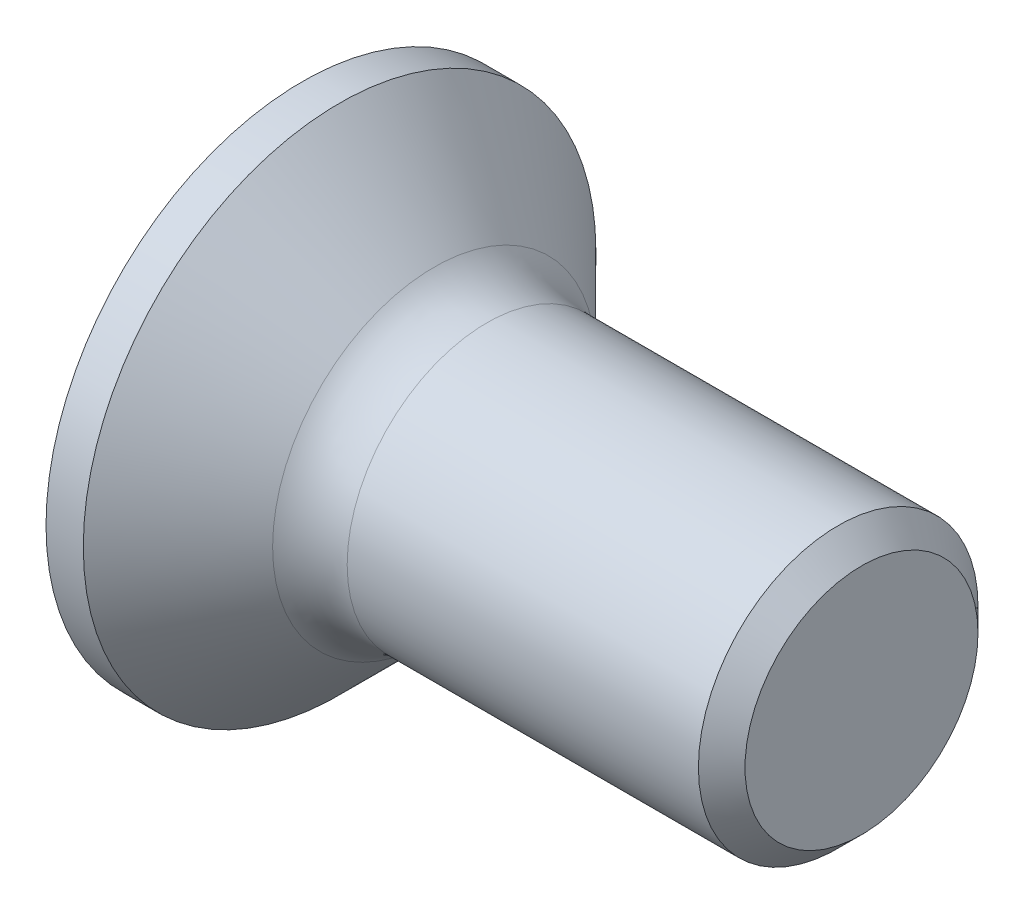
ISO-10303-21;
HEADER;
FILE_DESCRIPTION(('STEP AP214'),'2;1');
FILE_NAME('part.step','',(''),(''),'','','');
FILE_SCHEMA(('AUTOMOTIVE_DESIGN { 1 0 10303 214 1 1 1 1 }'));
ENDSEC;
DATA;
#1=APPLICATION_CONTEXT('core data for automotive mechanical design processes');
#2=APPLICATION_PROTOCOL_DEFINITION('international standard','automotive_design',2000,#1);
#3=PRODUCT_CONTEXT('',#1,'mechanical');
#4=PRODUCT('Part','Part','',(#3));
#5=PRODUCT_RELATED_PRODUCT_CATEGORY('part','',(#4));
#6=PRODUCT_DEFINITION_FORMATION('','',#4);
#7=PRODUCT_DEFINITION_CONTEXT('part definition',#1,'design');
#8=PRODUCT_DEFINITION('design','',#6,#7);
#9=PRODUCT_DEFINITION_SHAPE('','',#8);
#10=(LENGTH_UNIT() NAMED_UNIT(*) SI_UNIT(.MILLI.,.METRE.));
#11=(NAMED_UNIT(*) PLANE_ANGLE_UNIT() SI_UNIT($,.RADIAN.));
#12=(NAMED_UNIT(*) SI_UNIT($,.STERADIAN.) SOLID_ANGLE_UNIT());
#13=UNCERTAINTY_MEASURE_WITH_UNIT(LENGTH_MEASURE(1.E-05),#10,'distance_accuracy_value','');
#14=(GEOMETRIC_REPRESENTATION_CONTEXT(3) GLOBAL_UNCERTAINTY_ASSIGNED_CONTEXT((#13)) GLOBAL_UNIT_ASSIGNED_CONTEXT((#10,
#11,#12)) REPRESENTATION_CONTEXT('',''));
#15=CARTESIAN_POINT('',(0.,0.,0.));
#16=DIRECTION('',(0.,0.,1.));
#17=DIRECTION('',(1.,0.,0.));
#18=AXIS2_PLACEMENT_3D('',#15,#16,#17);
#19=CARTESIAN_POINT('',(0.,0.,0.));
#20=DIRECTION('',(-1.,0.,0.));
#21=DIRECTION('',(0.,0.,1.));
#22=AXIS2_PLACEMENT_3D('',#19,#20,#21);
#23=PLANE('',#22);
#24=CARTESIAN_POINT('',(0.,0.,0.));
#25=DIRECTION('',(-1.,0.,0.));
#26=DIRECTION('',(0.,0.,1.));
#27=AXIS2_PLACEMENT_3D('',#24,#25,#26);
#28=CIRCLE('',#27,2.75);
#29=CARTESIAN_POINT('',(0.,0.,2.75));
#30=VERTEX_POINT('',#29);
#31=EDGE_CURVE('E241',#30,#30,#28,.T.);
#32=ORIENTED_EDGE('',*,*,#31,.T.);
#33=EDGE_LOOP('',(#32));
#34=FACE_BOUND('',#33,.T.);
#35=DIRECTION('',(0.,0.,-1.));
#36=VECTOR('',#35,1.);
#37=CARTESIAN_POINT('',(0.,-0.370000000000005,1.5));
#38=LINE('',#37,#36);
#39=CARTESIAN_POINT('',(0.,-0.370000000000005,1.5));
#40=VERTEX_POINT('',#39);
#41=CARTESIAN_POINT('',(0.,-0.370000000000002,0.590157547916261));
#42=VERTEX_POINT('',#41);
#43=EDGE_CURVE('E330',#40,#42,#38,.T.);
#44=ORIENTED_EDGE('',*,*,#43,.T.);
#45=CARTESIAN_POINT('',(0.,0.,0.));
#46=DIRECTION('',(-1.,0.,0.));
#47=DIRECTION('',(0.,0.,1.));
#48=AXIS2_PLACEMENT_3D('',#45,#46,#47);
#49=CIRCLE('',#48,0.69655289200644);
#50=CARTESIAN_POINT('',(0.,-0.590157547916262,0.37));
#51=VERTEX_POINT('',#50);
#52=EDGE_CURVE('E365',#51,#42,#49,.T.);
#53=ORIENTED_EDGE('',*,*,#52,.F.);
#54=DIRECTION('',(0.,-1.,0.));
#55=VECTOR('',#54,1.);
#56=CARTESIAN_POINT('',(0.,1.5,0.37));
#57=LINE('',#56,#55);
#58=CARTESIAN_POINT('',(0.,-1.5,0.37));
#59=VERTEX_POINT('',#58);
#60=EDGE_CURVE('E282',#51,#59,#57,.T.);
#61=ORIENTED_EDGE('',*,*,#60,.T.);
#62=DIRECTION('',(0.,0.,-1.));
#63=VECTOR('',#62,1.);
#64=CARTESIAN_POINT('',(0.,-1.5,0.37));
#65=LINE('',#64,#63);
#66=CARTESIAN_POINT('',(0.,-1.5,-0.37));
#67=VERTEX_POINT('',#66);
#68=EDGE_CURVE('E287',#59,#67,#65,.T.);
#69=ORIENTED_EDGE('',*,*,#68,.T.);
#70=DIRECTION('',(0.,1.,0.));
#71=VECTOR('',#70,1.);
#72=CARTESIAN_POINT('',(0.,-1.5,-0.37));
#73=LINE('',#72,#71);
#74=CARTESIAN_POINT('',(0.,-0.590157547916263,-0.37));
#75=VERTEX_POINT('',#74);
#76=EDGE_CURVE('E283',#67,#75,#73,.T.);
#77=ORIENTED_EDGE('',*,*,#76,.T.);
#78=CARTESIAN_POINT('',(0.,-0.369999999999998,-0.590157547916264));
#79=VERTEX_POINT('',#78);
#80=EDGE_CURVE('E369',#79,#75,#49,.T.);
#81=ORIENTED_EDGE('',*,*,#80,.F.);
#82=CARTESIAN_POINT('',(0.,-0.369999999999995,-1.5));
#83=VERTEX_POINT('',#82);
#84=EDGE_CURVE('E335',#79,#83,#38,.T.);
#85=ORIENTED_EDGE('',*,*,#84,.T.);
#86=DIRECTION('',(0.,1.,0.));
#87=VECTOR('',#86,1.);
#88=CARTESIAN_POINT('',(0.,-0.369999999999995,-1.5));
#89=LINE('',#88,#87);
#90=CARTESIAN_POINT('',(0.,0.370000000000005,-1.5));
#91=VERTEX_POINT('',#90);
#92=EDGE_CURVE('E323',#83,#91,#89,.T.);
#93=ORIENTED_EDGE('',*,*,#92,.T.);
#94=DIRECTION('',(0.,0.,1.));
#95=VECTOR('',#94,1.);
#96=CARTESIAN_POINT('',(0.,0.370000000000005,-1.5));
#97=LINE('',#96,#95);
#98=CARTESIAN_POINT('',(0.,0.370000000000002,-0.590157547916261));
#99=VERTEX_POINT('',#98);
#100=EDGE_CURVE('E339',#91,#99,#97,.T.);
#101=ORIENTED_EDGE('',*,*,#100,.T.);
#102=CARTESIAN_POINT('',(0.,0.590157547916263,-0.37));
#103=VERTEX_POINT('',#102);
#104=EDGE_CURVE('E555',#103,#99,#49,.T.);
#105=ORIENTED_EDGE('',*,*,#104,.F.);
#106=CARTESIAN_POINT('',(0.,1.5,-0.37));
#107=VERTEX_POINT('',#106);
#108=EDGE_CURVE('E292',#103,#107,#73,.T.);
#109=ORIENTED_EDGE('',*,*,#108,.T.);
#110=DIRECTION('',(0.,0.,1.));
#111=VECTOR('',#110,1.);
#112=CARTESIAN_POINT('',(0.,1.5,-0.37));
#113=LINE('',#112,#111);
#114=CARTESIAN_POINT('',(0.,1.5,0.37));
#115=VERTEX_POINT('',#114);
#116=EDGE_CURVE('E279',#107,#115,#113,.T.);
#117=ORIENTED_EDGE('',*,*,#116,.T.);
#118=CARTESIAN_POINT('',(0.,0.590157547916263,0.37));
#119=VERTEX_POINT('',#118);
#120=EDGE_CURVE('E284',#115,#119,#57,.T.);
#121=ORIENTED_EDGE('',*,*,#120,.T.);
#122=CARTESIAN_POINT('',(0.,0.369999999999998,0.590157547916264));
#123=VERTEX_POINT('',#122);
#124=EDGE_CURVE('E371',#123,#119,#49,.T.);
#125=ORIENTED_EDGE('',*,*,#124,.F.);
#126=CARTESIAN_POINT('',(0.,0.369999999999994,1.5));
#127=VERTEX_POINT('',#126);
#128=EDGE_CURVE('E342',#123,#127,#97,.T.);
#129=ORIENTED_EDGE('',*,*,#128,.T.);
#130=DIRECTION('',(0.,-1.,0.));
#131=VECTOR('',#130,1.);
#132=CARTESIAN_POINT('',(0.,0.369999999999994,1.5));
#133=LINE('',#132,#131);
#134=EDGE_CURVE('E341',#127,#40,#133,.T.);
#135=ORIENTED_EDGE('',*,*,#134,.T.);
#136=EDGE_LOOP('',(#44,#53,#61,#69,#77,#81,#85,#93,#101,#105,#109,#117,#121,#125,#129,#135));
#137=FACE_BOUND('',#136,.T.);
#138=ADVANCED_FACE('F34',(#34,#137),#23,.T.);
#139=CARTESIAN_POINT('',(2.01,-0.49785100239185,0.37));
#140=DIRECTION('',(0.,0.,-1.));
#141=DIRECTION('',(0.,1.,0.));
#142=AXIS2_PLACEMENT_3D('',#139,#140,#141);
#143=PLANE('',#142);
#144=ORIENTED_EDGE('',*,*,#60,.F.);
#145=CARTESIAN_POINT('',(-1.01053649699026,-0.672102030078458,0.37));
#146=CARTESIAN_POINT('',(-0.799706058781647,-0.65526709888962,0.37));
#147=CARTESIAN_POINT('',(-0.588886212565098,-0.638297110577309,0.37));
#148=CARTESIAN_POINT('',(-0.167272662573759,-0.603984130523452,0.37));
#149=CARTESIAN_POINT('',(0.0435210405937217,-0.586641131327184,0.37));
#150=CARTESIAN_POINT('',(0.465068838236452,-0.551479911668094,0.37));
#151=CARTESIAN_POINT('',(0.675822932725247,-0.533661691368078,0.37));
#152=CARTESIAN_POINT('',(1.09727362087867,-0.497387538868942,0.37));
#153=CARTESIAN_POINT('',(1.30797021528206,-0.478931615293404,0.37));
#154=CARTESIAN_POINT('',(1.67418894765493,-0.446067164114376,0.37));
#155=CARTESIAN_POINT('',(1.82972932594024,-0.431862501020785,0.37));
#156=CARTESIAN_POINT('',(2.14074770367772,-0.402797709732015,0.37));
#157=CARTESIAN_POINT('',(2.29622570364502,-0.38793758706717,0.37));
#158=CARTESIAN_POINT('',(2.60710169356699,-0.357305117929346,0.37));
#159=CARTESIAN_POINT('',(2.76249967848536,-0.341532719782115,0.37));
#160=CARTESIAN_POINT('',(2.99549070750468,-0.316847908272698,0.37));
#161=CARTESIAN_POINT('',(3.07313791127142,-0.308448465888148,0.37));
#162=CARTESIAN_POINT('',(3.22838341584044,-0.291202251038989,0.37));
#163=CARTESIAN_POINT('',(3.30598171607669,-0.282355473489553,0.37));
#164=CARTESIAN_POINT('',(3.38354828471668,-0.273232461280215,0.37));
#165=B_SPLINE_CURVE_WITH_KNOTS('',3,(#145,#146,#147,#148,#149,#150,#151,#152,#153,#154,#155,
#156,#157,#158,#159,#160,#161,#162,#163,#164),.UNSPECIFIED.,.F.,.F.,(4,2,2,2,2,2,2,2,2,4),(0.,
0.634504777580944,1.26902224771403,1.90353950046914,2.53804817608336,3.00661008454961,
3.47516804035678,3.94375256285268,4.17805198347564,4.41235406796206),.UNSPECIFIED.);
#166=CARTESIAN_POINT('',(2.01,-0.415013252800437,0.37));
#167=VERTEX_POINT('',#166);
#168=EDGE_CURVE('E361',#51,#167,#165,.T.);
#169=ORIENTED_EDGE('',*,*,#168,.T.);
#170=DIRECTION('',(0.,-1.,0.));
#171=VECTOR('',#170,1.);
#172=CARTESIAN_POINT('',(2.01,0.497851002391851,0.37));
#173=LINE('',#172,#171);
#174=CARTESIAN_POINT('',(2.01,-0.497851002391851,0.37));
#175=VERTEX_POINT('',#174);
#176=EDGE_CURVE('E307',#167,#175,#173,.T.);
#177=ORIENTED_EDGE('',*,*,#176,.T.);
#178=DIRECTION('',(0.89493436774996,0.446197800778958,0.));
#179=VECTOR('',#178,1.);
#180=CARTESIAN_POINT('',(0.,-1.5,0.37));
#181=LINE('',#180,#179);
#182=EDGE_CURVE('E293',#59,#175,#181,.T.);
#183=ORIENTED_EDGE('',*,*,#182,.F.);
#184=EDGE_LOOP('',(#144,#169,#177,#183));
#185=FACE_BOUND('',#184,.T.);
#186=ADVANCED_FACE('F190',(#185),#143,.T.);
#187=CARTESIAN_POINT('',(2.01,0.497851002391851,0.37));
#188=VERTEX_POINT('',#187);
#189=CARTESIAN_POINT('',(2.01,0.415013252800437,0.37));
#190=VERTEX_POINT('',#189);
#191=EDGE_CURVE('E309',#188,#190,#173,.T.);
#192=ORIENTED_EDGE('',*,*,#191,.T.);
#193=CARTESIAN_POINT('',(-1.01053649691082,0.672102030072117,0.37));
#194=CARTESIAN_POINT('',(-0.799706058711029,0.655267098883947,0.37));
#195=CARTESIAN_POINT('',(-0.588886212503304,0.638297110572311,0.37));
#196=CARTESIAN_POINT('',(-0.16727266252961,0.603984130519827,0.37));
#197=CARTESIAN_POINT('',(0.0435210406290472,0.586641131324258,0.37));
#198=CARTESIAN_POINT('',(0.465068838244709,0.551479911667385,0.37));
#199=CARTESIAN_POINT('',(0.67582293271526,0.533661691368909,0.37));
#200=CARTESIAN_POINT('',(1.09727362083221,0.497387538872971,0.37));
#201=CARTESIAN_POINT('',(1.30797021521736,0.478931615299089,0.37));
#202=CARTESIAN_POINT('',(1.67418894757201,0.446067164121905,0.37));
#203=CARTESIAN_POINT('',(1.82972932585734,0.431862501028414,0.37));
#204=CARTESIAN_POINT('',(2.14074770359484,0.40279770973988,0.37));
#205=CARTESIAN_POINT('',(2.29622570356215,0.38793758707517,0.37));
#206=CARTESIAN_POINT('',(2.60710169348415,0.357305117937676,0.37));
#207=CARTESIAN_POINT('',(2.76249967840253,0.34153271979064,0.37));
#208=CARTESIAN_POINT('',(2.99549070742189,0.316847908281594,0.37));
#209=CARTESIAN_POINT('',(3.07313791118864,0.308448465897182,0.37));
#210=CARTESIAN_POINT('',(3.22838341575769,0.291202251048339,0.37));
#211=CARTESIAN_POINT('',(3.30598171599396,0.282355473499082,0.37));
#212=CARTESIAN_POINT('',(3.38354828463398,0.273232461289951,0.37));
#213=B_SPLINE_CURVE_WITH_KNOTS('',3,(#193,#194,#195,#196,#197,#198,#199,#200,#201,#202,#203,
#204,#205,#206,#207,#208,#209,#210,#211,#212),.UNSPECIFIED.,.F.,.F.,(4,2,2,2,2,2,2,2,2,4),(0.,
0.634504777554396,1.26902224766093,1.90353950036111,2.53804817592041,3.00661008438666,
3.47516804019383,3.94375256268972,4.17805198331267,4.41235406779909),.UNSPECIFIED.);
#214=EDGE_CURVE('E418',#190,#119,#213,.F.);
#215=ORIENTED_EDGE('',*,*,#214,.T.);
#216=ORIENTED_EDGE('',*,*,#120,.F.);
#217=DIRECTION('',(0.89493436774996,-0.446197800778958,0.));
#218=VECTOR('',#217,1.);
#219=CARTESIAN_POINT('',(0.,1.5,0.37));
#220=LINE('',#219,#218);
#221=EDGE_CURVE('E57',#115,#188,#220,.T.);
#222=ORIENTED_EDGE('',*,*,#221,.T.);
#223=EDGE_LOOP('',(#192,#215,#216,#222));
#224=FACE_BOUND('',#223,.T.);
#225=ADVANCED_FACE('F196',(#224),#143,.T.);
#226=CARTESIAN_POINT('',(2.01,0.497851002391851,-0.37));
#227=DIRECTION('',(0.,0.,1.));
#228=DIRECTION('',(1.,0.,0.));
#229=AXIS2_PLACEMENT_3D('',#226,#227,#228);
#230=PLANE('',#229);
#231=DIRECTION('',(0.,1.,0.));
#232=VECTOR('',#231,1.);
#233=CARTESIAN_POINT('',(2.01,-0.497851002391851,-0.37));
#234=LINE('',#233,#232);
#235=CARTESIAN_POINT('',(2.01,-0.497851002391851,-0.37));
#236=VERTEX_POINT('',#235);
#237=CARTESIAN_POINT('',(2.01,-0.415013252800437,-0.37));
#238=VERTEX_POINT('',#237);
#239=EDGE_CURVE('E315',#236,#238,#234,.T.);
#240=ORIENTED_EDGE('',*,*,#239,.T.);
#241=CARTESIAN_POINT('',(-1.01053649699026,-0.672102030078459,-0.369999999999999));
#242=CARTESIAN_POINT('',(-0.799706058781647,-0.65526709888962,-0.37));
#243=CARTESIAN_POINT('',(-0.588886212565098,-0.638297110577309,-0.37));
#244=CARTESIAN_POINT('',(-0.167272662573758,-0.603984130523452,-0.37));
#245=CARTESIAN_POINT('',(0.0435210405937223,-0.586641131327184,-0.37));
#246=CARTESIAN_POINT('',(0.465068838236453,-0.551479911668094,-0.37));
#247=CARTESIAN_POINT('',(0.675822932725248,-0.533661691368078,-0.37));
#248=CARTESIAN_POINT('',(1.09727362087867,-0.497387538868943,-0.37));
#249=CARTESIAN_POINT('',(1.30797021528206,-0.478931615293404,-0.37));
#250=CARTESIAN_POINT('',(1.67418894765493,-0.446067164114376,-0.37));
#251=CARTESIAN_POINT('',(1.82972932594025,-0.431862501020785,-0.37));
#252=CARTESIAN_POINT('',(2.14074770367772,-0.402797709732015,-0.37));
#253=CARTESIAN_POINT('',(2.29622570364503,-0.38793758706717,-0.37));
#254=CARTESIAN_POINT('',(2.60710169356699,-0.357305117929346,-0.37));
#255=CARTESIAN_POINT('',(2.76249967848536,-0.341532719782115,-0.37));
#256=CARTESIAN_POINT('',(2.99549070750468,-0.316847908272698,-0.37));
#257=CARTESIAN_POINT('',(3.07313791127142,-0.308448465888148,-0.37));
#258=CARTESIAN_POINT('',(3.22838341584044,-0.291202251038989,-0.37));
#259=CARTESIAN_POINT('',(3.30598171607669,-0.282355473489553,-0.37));
#260=CARTESIAN_POINT('',(3.38354828471668,-0.273232461280215,-0.37));
#261=B_SPLINE_CURVE_WITH_KNOTS('',3,(#241,#242,#243,#244,#245,#246,#247,#248,#249,#250,#251,
#252,#253,#254,#255,#256,#257,#258,#259,#260),.UNSPECIFIED.,.F.,.F.,(4,2,2,2,2,2,2,2,2,4),(0.,
0.634504777580944,1.26902224771403,1.90353950046914,2.53804817608336,3.00661008454961,
3.47516804035678,3.94375256285268,4.17805198347564,4.41235406796206),.UNSPECIFIED.);
#262=EDGE_CURVE('E425',#238,#75,#261,.F.);
#263=ORIENTED_EDGE('',*,*,#262,.T.);
#264=ORIENTED_EDGE('',*,*,#76,.F.);
#265=DIRECTION('',(0.89493436774996,0.446197800778958,0.));
#266=VECTOR('',#265,1.);
#267=CARTESIAN_POINT('',(0.,-1.5,-0.37));
#268=LINE('',#267,#266);
#269=EDGE_CURVE('E296',#67,#236,#268,.T.);
#270=ORIENTED_EDGE('',*,*,#269,.T.);
#271=EDGE_LOOP('',(#240,#263,#264,#270));
#272=FACE_BOUND('',#271,.T.);
#273=ADVANCED_FACE('F511',(#272),#230,.T.);
#274=ORIENTED_EDGE('',*,*,#108,.F.);
#275=CARTESIAN_POINT('',(-1.01053649699026,0.672102030078459,-0.369999999999999));
#276=CARTESIAN_POINT('',(-0.799706058781647,0.65526709888962,-0.37));
#277=CARTESIAN_POINT('',(-0.588886212565098,0.638297110577309,-0.37));
#278=CARTESIAN_POINT('',(-0.167272662573758,0.603984130523452,-0.37));
#279=CARTESIAN_POINT('',(0.0435210405937222,0.586641131327184,-0.37));
#280=CARTESIAN_POINT('',(0.465068838236453,0.551479911668094,-0.37));
#281=CARTESIAN_POINT('',(0.675822932725247,0.533661691368078,-0.37));
#282=CARTESIAN_POINT('',(1.09727362087867,0.497387538868943,-0.37));
#283=CARTESIAN_POINT('',(1.30797021528206,0.478931615293404,-0.37));
#284=CARTESIAN_POINT('',(1.67418894765493,0.446067164114376,-0.37));
#285=CARTESIAN_POINT('',(1.82972932594025,0.431862501020785,-0.37));
#286=CARTESIAN_POINT('',(2.14074770367772,0.402797709732015,-0.37));
#287=CARTESIAN_POINT('',(2.29622570364503,0.38793758706717,-0.37));
#288=CARTESIAN_POINT('',(2.60710169356699,0.357305117929346,-0.37));
#289=CARTESIAN_POINT('',(2.76249967848536,0.341532719782115,-0.37));
#290=CARTESIAN_POINT('',(2.99549070750468,0.316847908272698,-0.37));
#291=CARTESIAN_POINT('',(3.07313791127142,0.308448465888148,-0.37));
#292=CARTESIAN_POINT('',(3.22838341584044,0.291202251038989,-0.37));
#293=CARTESIAN_POINT('',(3.30598171607669,0.282355473489553,-0.37));
#294=CARTESIAN_POINT('',(3.38354828471668,0.273232461280215,-0.37));
#295=B_SPLINE_CURVE_WITH_KNOTS('',3,(#275,#276,#277,#278,#279,#280,#281,#282,#283,#284,#285,
#286,#287,#288,#289,#290,#291,#292,#293,#294),.UNSPECIFIED.,.F.,.F.,(4,2,2,2,2,2,2,2,2,4),(0.,
0.634504777580944,1.26902224771403,1.90353950046914,2.53804817608336,3.00661008454961,
3.47516804035678,3.94375256285268,4.17805198347564,4.41235406796206),.UNSPECIFIED.);
#296=CARTESIAN_POINT('',(2.01,0.415013252800437,-0.37));
#297=VERTEX_POINT('',#296);
#298=EDGE_CURVE('E423',#103,#297,#295,.T.);
#299=ORIENTED_EDGE('',*,*,#298,.T.);
#300=CARTESIAN_POINT('',(2.01,0.497851002391851,-0.37));
#301=VERTEX_POINT('',#300);
#302=EDGE_CURVE('E317',#297,#301,#234,.T.);
#303=ORIENTED_EDGE('',*,*,#302,.T.);
#304=DIRECTION('',(0.89493436774996,-0.446197800778958,0.));
#305=VECTOR('',#304,1.);
#306=CARTESIAN_POINT('',(0.,1.5,-0.37));
#307=LINE('',#306,#305);
#308=EDGE_CURVE('E300',#107,#301,#307,.T.);
#309=ORIENTED_EDGE('',*,*,#308,.F.);
#310=EDGE_LOOP('',(#274,#299,#303,#309));
#311=FACE_BOUND('',#310,.T.);
#312=ADVANCED_FACE('F422',(#311),#230,.T.);
#313=CARTESIAN_POINT('',(2.01,0.497851002391851,-0.37));
#314=DIRECTION('',(1.,0.,0.));
#315=DIRECTION('',(0.,0.,-1.));
#316=AXIS2_PLACEMENT_3D('',#313,#314,#315);
#317=PLANE('',#316);
#318=CARTESIAN_POINT('',(2.01,0.,0.));
#319=DIRECTION('',(-1.,0.,0.));
#320=DIRECTION('',(0.,0.,1.));
#321=AXIS2_PLACEMENT_3D('',#318,#319,#320);
#322=CIRCLE('',#321,0.555999999999999);
#323=CARTESIAN_POINT('',(2.01,-0.247548741498372,-0.497851002391851));
#324=VERTEX_POINT('',#323);
#325=CARTESIAN_POINT('',(2.01,-0.369999999999999,-0.415013252800438));
#326=VERTEX_POINT('',#325);
#327=EDGE_CURVE('E386',#324,#326,#322,.T.);
#328=ORIENTED_EDGE('',*,*,#327,.F.);
#329=DIRECTION('',(0.,1.,0.));
#330=VECTOR('',#329,1.);
#331=CARTESIAN_POINT('',(2.01,-0.369999999999998,-0.497851002391852));
#332=LINE('',#331,#330);
#333=CARTESIAN_POINT('',(2.01,-0.369999999999998,-0.497851002391852));
#334=VERTEX_POINT('',#333);
#335=EDGE_CURVE('E276',#334,#324,#332,.T.);
#336=ORIENTED_EDGE('',*,*,#335,.F.);
#337=DIRECTION('',(0.,0.,-1.));
#338=VECTOR('',#337,1.);
#339=CARTESIAN_POINT('',(2.01,-0.370000000000002,0.497851002391849));
#340=LINE('',#339,#338);
#341=EDGE_CURVE('E266',#326,#334,#340,.T.);
#342=ORIENTED_EDGE('',*,*,#341,.F.);
#343=EDGE_LOOP('',(#328,#336,#342));
#344=FACE_BOUND('',#343,.T.);
#345=ADVANCED_FACE('F203',(#344),#317,.F.);
#346=CARTESIAN_POINT('',(2.01,-0.497851002391851,-0.247548741498373));
#347=VERTEX_POINT('',#346);
#348=EDGE_CURVE('E380',#238,#347,#322,.T.);
#349=ORIENTED_EDGE('',*,*,#348,.F.);
#350=ORIENTED_EDGE('',*,*,#239,.F.);
#351=DIRECTION('',(0.,0.,-1.));
#352=VECTOR('',#351,1.);
#353=CARTESIAN_POINT('',(2.01,-0.497851002391851,0.37));
#354=LINE('',#353,#352);
#355=EDGE_CURVE('E312',#347,#236,#354,.T.);
#356=ORIENTED_EDGE('',*,*,#355,.F.);
#357=EDGE_LOOP('',(#349,#350,#356));
#358=FACE_BOUND('',#357,.T.);
#359=ADVANCED_FACE('F447',(#358),#317,.F.);
#360=CARTESIAN_POINT('',(2.01,-0.497851002391851,0.247548741498374));
#361=VERTEX_POINT('',#360);
#362=EDGE_CURVE('E374',#361,#167,#322,.T.);
#363=ORIENTED_EDGE('',*,*,#362,.F.);
#364=EDGE_CURVE('E303',#175,#361,#354,.T.);
#365=ORIENTED_EDGE('',*,*,#364,.F.);
#366=ORIENTED_EDGE('',*,*,#176,.F.);
#367=EDGE_LOOP('',(#363,#365,#366));
#368=FACE_BOUND('',#367,.T.);
#369=ADVANCED_FACE('F443',(#368),#317,.F.);
#370=CARTESIAN_POINT('',(2.01,-0.370000000000002,0.415013252800435));
#371=VERTEX_POINT('',#370);
#372=CARTESIAN_POINT('',(2.01,-0.247548741498376,0.49785100239185));
#373=VERTEX_POINT('',#372);
#374=EDGE_CURVE('E49',#371,#373,#322,.T.);
#375=ORIENTED_EDGE('',*,*,#374,.F.);
#376=CARTESIAN_POINT('',(2.01,-0.370000000000002,0.497851002391849));
#377=VERTEX_POINT('',#376);
#378=EDGE_CURVE('E263',#377,#371,#340,.T.);
#379=ORIENTED_EDGE('',*,*,#378,.F.);
#380=DIRECTION('',(0.,-1.,0.));
#381=VECTOR('',#380,1.);
#382=CARTESIAN_POINT('',(2.01,0.369999999999998,0.497851002391852));
#383=LINE('',#382,#381);
#384=EDGE_CURVE('E254',#373,#377,#383,.T.);
#385=ORIENTED_EDGE('',*,*,#384,.F.);
#386=EDGE_LOOP('',(#375,#379,#385));
#387=FACE_BOUND('',#386,.T.);
#388=ADVANCED_FACE('F261',(#387),#317,.F.);
#389=CARTESIAN_POINT('',(2.01,0.247548741498372,0.497851002391851));
#390=VERTEX_POINT('',#389);
#391=CARTESIAN_POINT('',(2.01,0.369999999999999,0.415013252800438));
#392=VERTEX_POINT('',#391);
#393=EDGE_CURVE('E363',#390,#392,#322,.T.);
#394=ORIENTED_EDGE('',*,*,#393,.F.);
#395=CARTESIAN_POINT('',(2.01,0.369999999999998,0.497851002391852));
#396=VERTEX_POINT('',#395);
#397=EDGE_CURVE('E258',#396,#390,#383,.T.);
#398=ORIENTED_EDGE('',*,*,#397,.F.);
#399=DIRECTION('',(0.,0.,1.));
#400=VECTOR('',#399,1.);
#401=CARTESIAN_POINT('',(2.01,0.370000000000002,-0.49785100239185));
#402=LINE('',#401,#400);
#403=EDGE_CURVE('E268',#392,#396,#402,.T.);
#404=ORIENTED_EDGE('',*,*,#403,.F.);
#405=EDGE_LOOP('',(#394,#398,#404));
#406=FACE_BOUND('',#405,.T.);
#407=ADVANCED_FACE('F362',(#406),#317,.F.);
#408=CARTESIAN_POINT('',(2.01,0.497851002391851,0.247548741498373));
#409=VERTEX_POINT('',#408);
#410=EDGE_CURVE('E372',#190,#409,#322,.T.);
#411=ORIENTED_EDGE('',*,*,#410,.F.);
#412=ORIENTED_EDGE('',*,*,#191,.F.);
#413=DIRECTION('',(0.,0.,1.));
#414=VECTOR('',#413,1.);
#415=CARTESIAN_POINT('',(2.01,0.497851002391851,-0.37));
#416=LINE('',#415,#414);
#417=EDGE_CURVE('E308',#409,#188,#416,.T.);
#418=ORIENTED_EDGE('',*,*,#417,.F.);
#419=EDGE_LOOP('',(#411,#412,#418));
#420=FACE_BOUND('',#419,.T.);
#421=ADVANCED_FACE('F415',(#420),#317,.F.);
#422=CARTESIAN_POINT('',(2.01,0.497851002391851,-0.247548741498373));
#423=VERTEX_POINT('',#422);
#424=EDGE_CURVE('E398',#423,#297,#322,.T.);
#425=ORIENTED_EDGE('',*,*,#424,.F.);
#426=EDGE_CURVE('E304',#301,#423,#416,.T.);
#427=ORIENTED_EDGE('',*,*,#426,.F.);
#428=ORIENTED_EDGE('',*,*,#302,.F.);
#429=EDGE_LOOP('',(#425,#427,#428));
#430=FACE_BOUND('',#429,.T.);
#431=ADVANCED_FACE('F428',(#430),#317,.F.);
#432=CARTESIAN_POINT('',(2.01,0.370000000000002,-0.415013252800435));
#433=VERTEX_POINT('',#432);
#434=CARTESIAN_POINT('',(2.01,0.247548741498375,-0.49785100239185));
#435=VERTEX_POINT('',#434);
#436=EDGE_CURVE('E392',#433,#435,#322,.T.);
#437=ORIENTED_EDGE('',*,*,#436,.F.);
#438=CARTESIAN_POINT('',(2.01,0.370000000000002,-0.49785100239185));
#439=VERTEX_POINT('',#438);
#440=EDGE_CURVE('E264',#439,#433,#402,.T.);
#441=ORIENTED_EDGE('',*,*,#440,.F.);
#442=EDGE_CURVE('E275',#435,#439,#332,.T.);
#443=ORIENTED_EDGE('',*,*,#442,.F.);
#444=EDGE_LOOP('',(#437,#441,#443));
#445=FACE_BOUND('',#444,.T.);
#446=ADVANCED_FACE('F430',(#445),#317,.F.);
#447=CARTESIAN_POINT('',(2.01,-0.497851002391851,-0.37));
#448=DIRECTION('',(-0.446197800778958,0.89493436774996,0.));
#449=DIRECTION('',(-0.89493436774996,-0.446197800778958,0.));
#450=AXIS2_PLACEMENT_3D('',#447,#448,#449);
#451=PLANE('',#450);
#452=ORIENTED_EDGE('',*,*,#364,.T.);
#453=CARTESIAN_POINT('',(2.86902882959523,-0.0695550419463994,0.));
#454=DIRECTION('',(-0.446197800778958,0.89493436774996,0.));
#455=DIRECTION('',(-0.89493436774996,-0.446197800778958,0.));
#456=AXIS2_PLACEMENT_3D('',#453,#454,#455);
#457=ELLIPSE('',#456,1.11145965245249,0.491029028347017);
#458=EDGE_CURVE('E412',#361,#347,#457,.F.);
#459=ORIENTED_EDGE('',*,*,#458,.T.);
#460=ORIENTED_EDGE('',*,*,#355,.T.);
#461=ORIENTED_EDGE('',*,*,#269,.F.);
#462=ORIENTED_EDGE('',*,*,#68,.F.);
#463=ORIENTED_EDGE('',*,*,#182,.T.);
#464=EDGE_LOOP('',(#452,#459,#460,#461,#462,#463));
#465=FACE_BOUND('',#464,.T.);
#466=ADVANCED_FACE('F435',(#465),#451,.T.);
#467=CARTESIAN_POINT('',(2.01,0.497851002391851,0.37));
#468=DIRECTION('',(-0.446197800778958,-0.89493436774996,0.));
#469=DIRECTION('',(0.89493436774996,-0.446197800778958,0.));
#470=AXIS2_PLACEMENT_3D('',#467,#468,#469);
#471=PLANE('',#470);
#472=ORIENTED_EDGE('',*,*,#426,.T.);
#473=CARTESIAN_POINT('',(2.86902882959523,0.0695550419463994,0.));
#474=DIRECTION('',(-0.446197800778958,-0.89493436774996,0.));
#475=DIRECTION('',(-0.89493436774996,0.446197800778958,0.));
#476=AXIS2_PLACEMENT_3D('',#473,#474,#475);
#477=ELLIPSE('',#476,1.11145965245249,0.491029028347017);
#478=EDGE_CURVE('E409',#423,#409,#477,.F.);
#479=ORIENTED_EDGE('',*,*,#478,.T.);
#480=ORIENTED_EDGE('',*,*,#417,.T.);
#481=ORIENTED_EDGE('',*,*,#221,.F.);
#482=ORIENTED_EDGE('',*,*,#116,.F.);
#483=ORIENTED_EDGE('',*,*,#308,.T.);
#484=EDGE_LOOP('',(#472,#479,#480,#481,#482,#483));
#485=FACE_BOUND('',#484,.T.);
#486=ADVANCED_FACE('F410',(#485),#471,.T.);
#487=CARTESIAN_POINT('',(2.01,0.369999999999998,0.497851002391852));
#488=DIRECTION('',(0.,-1.,0.));
#489=DIRECTION('',(1.,0.,0.));
#490=AXIS2_PLACEMENT_3D('',#487,#488,#489);
#491=PLANE('',#490);
#492=ORIENTED_EDGE('',*,*,#440,.T.);
#493=CARTESIAN_POINT('',(-1.01053649691082,0.370000000000002,-0.672102030072116));
#494=CARTESIAN_POINT('',(-0.79970605871103,0.370000000000002,-0.655267098883945));
#495=CARTESIAN_POINT('',(-0.588886212503304,0.370000000000002,-0.638297110572309));
#496=CARTESIAN_POINT('',(-0.16727266252961,0.370000000000002,-0.603984130519826));
#497=CARTESIAN_POINT('',(0.0435210406290473,0.370000000000002,-0.586641131324257));
#498=CARTESIAN_POINT('',(0.465068838244709,0.370000000000002,-0.551479911667384));
#499=CARTESIAN_POINT('',(0.67582293271526,0.370000000000002,-0.533661691368908));
#500=CARTESIAN_POINT('',(1.09727362083221,0.370000000000002,-0.497387538872969));
#501=CARTESIAN_POINT('',(1.30797021521736,0.370000000000001,-0.478931615299088));
#502=CARTESIAN_POINT('',(1.67418894757201,0.370000000000001,-0.446067164121904));
#503=CARTESIAN_POINT('',(1.82972932585734,0.370000000000001,-0.431862501028413));
#504=CARTESIAN_POINT('',(2.14074770359484,0.370000000000001,-0.402797709739878));
#505=CARTESIAN_POINT('',(2.29622570356215,0.370000000000001,-0.387937587075169));
#506=CARTESIAN_POINT('',(2.60710169348415,0.370000000000001,-0.357305117937675));
#507=CARTESIAN_POINT('',(2.76249967840253,0.370000000000001,-0.341532719790638));
#508=CARTESIAN_POINT('',(2.99549070742189,0.370000000000001,-0.316847908281593));
#509=CARTESIAN_POINT('',(3.07313791118864,0.370000000000001,-0.308448465897181));
#510=CARTESIAN_POINT('',(3.22838341575769,0.370000000000001,-0.291202251048338));
#511=CARTESIAN_POINT('',(3.30598171599396,0.370000000000001,-0.282355473499081));
#512=CARTESIAN_POINT('',(3.38354828463398,0.370000000000001,-0.273232461289949));
#513=B_SPLINE_CURVE_WITH_KNOTS('',3,(#493,#494,#495,#496,#497,#498,#499,#500,#501,#502,#503,
#504,#505,#506,#507,#508,#509,#510,#511,#512),.UNSPECIFIED.,.F.,.F.,(4,2,2,2,2,2,2,2,2,4),(0.,
0.634504777554396,1.26902224766093,1.90353950036111,2.53804817592041,3.00661008438666,
3.47516804019383,3.94375256268972,4.17805198331267,4.41235406779909),.UNSPECIFIED.);
#514=EDGE_CURVE('E413',#433,#99,#513,.F.);
#515=ORIENTED_EDGE('',*,*,#514,.T.);
#516=ORIENTED_EDGE('',*,*,#100,.F.);
#517=DIRECTION('',(0.89493436774996,0.,0.446197800778958));
#518=VECTOR('',#517,1.);
#519=CARTESIAN_POINT('',(0.,0.370000000000005,-1.5));
#520=LINE('',#519,#518);
#521=EDGE_CURVE('E346',#91,#439,#520,.T.);
#522=ORIENTED_EDGE('',*,*,#521,.T.);
#523=EDGE_LOOP('',(#492,#515,#516,#522));
#524=FACE_BOUND('',#523,.T.);
#525=ADVANCED_FACE('F516',(#524),#491,.T.);
#526=CARTESIAN_POINT('',(2.01,-0.369999999999998,-0.497851002391852));
#527=DIRECTION('',(0.,1.,0.));
#528=DIRECTION('',(0.,0.,1.));
#529=AXIS2_PLACEMENT_3D('',#526,#527,#528);
#530=PLANE('',#529);
#531=ORIENTED_EDGE('',*,*,#84,.F.);
#532=CARTESIAN_POINT('',(-1.01053649699026,-0.369999999999998,-0.67210203007846));
#533=CARTESIAN_POINT('',(-0.799706058781647,-0.369999999999998,-0.655267098889621));
#534=CARTESIAN_POINT('',(-0.588886212565098,-0.369999999999998,-0.63829711057731));
#535=CARTESIAN_POINT('',(-0.167272662573758,-0.369999999999998,-0.603984130523453));
#536=CARTESIAN_POINT('',(0.0435210405937218,-0.369999999999998,-0.586641131327185));
#537=CARTESIAN_POINT('',(0.465068838236452,-0.369999999999998,-0.551479911668095));
#538=CARTESIAN_POINT('',(0.675822932725247,-0.369999999999998,-0.533661691368079));
#539=CARTESIAN_POINT('',(1.09727362087867,-0.369999999999998,-0.497387538868944));
#540=CARTESIAN_POINT('',(1.30797021528206,-0.369999999999998,-0.478931615293405));
#541=CARTESIAN_POINT('',(1.67418894765493,-0.369999999999999,-0.446067164114377));
#542=CARTESIAN_POINT('',(1.82972932594024,-0.369999999999999,-0.431862501020786));
#543=CARTESIAN_POINT('',(2.14074770367772,-0.369999999999999,-0.402797709732016));
#544=CARTESIAN_POINT('',(2.29622570364502,-0.369999999999999,-0.387937587067171));
#545=CARTESIAN_POINT('',(2.60710169356699,-0.369999999999999,-0.357305117929347));
#546=CARTESIAN_POINT('',(2.76249967848536,-0.369999999999999,-0.341532719782116));
#547=CARTESIAN_POINT('',(2.99549070750468,-0.369999999999999,-0.316847908272699));
#548=CARTESIAN_POINT('',(3.07313791127142,-0.369999999999999,-0.308448465888149));
#549=CARTESIAN_POINT('',(3.22838341584044,-0.369999999999999,-0.29120225103899));
#550=CARTESIAN_POINT('',(3.30598171607669,-0.369999999999999,-0.282355473489555));
#551=CARTESIAN_POINT('',(3.38354828471668,-0.369999999999999,-0.273232461280216));
#552=B_SPLINE_CURVE_WITH_KNOTS('',3,(#532,#533,#534,#535,#536,#537,#538,#539,#540,#541,#542,
#543,#544,#545,#546,#547,#548,#549,#550,#551),.UNSPECIFIED.,.F.,.F.,(4,2,2,2,2,2,2,2,2,4),(0.,
0.634504777580943,1.26902224771403,1.90353950046914,2.53804817608336,3.00661008454961,
3.47516804035678,3.94375256285268,4.17805198347564,4.41235406796206),.UNSPECIFIED.);
#553=EDGE_CURVE('E494',#79,#326,#552,.T.);
#554=ORIENTED_EDGE('',*,*,#553,.T.);
#555=ORIENTED_EDGE('',*,*,#341,.T.);
#556=DIRECTION('',(0.89493436774996,0.,0.446197800778958));
#557=VECTOR('',#556,1.);
#558=CARTESIAN_POINT('',(0.,-0.369999999999995,-1.5));
#559=LINE('',#558,#557);
#560=EDGE_CURVE('E343',#83,#334,#559,.T.);
#561=ORIENTED_EDGE('',*,*,#560,.F.);
#562=EDGE_LOOP('',(#531,#554,#555,#561));
#563=FACE_BOUND('',#562,.T.);
#564=ADVANCED_FACE('F521',(#563),#530,.T.);
#565=CARTESIAN_POINT('',(2.01,0.370000000000002,-0.49785100239185));
#566=DIRECTION('',(-0.446197800778958,0.,0.89493436774996));
#567=DIRECTION('',(-0.89493436774996,0.,-0.446197800778958));
#568=AXIS2_PLACEMENT_3D('',#565,#566,#567);
#569=PLANE('',#568);
#570=ORIENTED_EDGE('',*,*,#335,.T.);
#571=CARTESIAN_POINT('',(2.86902882959523,0.,-0.0695550419463994));
#572=DIRECTION('',(-0.446197800778958,0.,0.89493436774996));
#573=DIRECTION('',(-0.89493436774996,0.,-0.446197800778958));
#574=AXIS2_PLACEMENT_3D('',#571,#572,#573);
#575=ELLIPSE('',#574,1.11145965245249,0.491029028347017);
#576=EDGE_CURVE('E544',#324,#435,#575,.F.);
#577=ORIENTED_EDGE('',*,*,#576,.T.);
#578=ORIENTED_EDGE('',*,*,#442,.T.);
#579=ORIENTED_EDGE('',*,*,#521,.F.);
#580=ORIENTED_EDGE('',*,*,#92,.F.);
#581=ORIENTED_EDGE('',*,*,#560,.T.);
#582=EDGE_LOOP('',(#570,#577,#578,#579,#580,#581));
#583=FACE_BOUND('',#582,.T.);
#584=ADVANCED_FACE('F475',(#583),#569,.T.);
#585=ORIENTED_EDGE('',*,*,#378,.T.);
#586=CARTESIAN_POINT('',(-1.01053649699026,-0.370000000000002,0.672102030078457));
#587=CARTESIAN_POINT('',(-0.799706058781647,-0.370000000000002,0.655267098889619));
#588=CARTESIAN_POINT('',(-0.588886212565098,-0.370000000000002,0.638297110577308));
#589=CARTESIAN_POINT('',(-0.167272662573758,-0.370000000000002,0.603984130523451));
#590=CARTESIAN_POINT('',(0.0435210405937222,-0.370000000000002,0.586641131327183));
#591=CARTESIAN_POINT('',(0.465068838236453,-0.370000000000002,0.551479911668092));
#592=CARTESIAN_POINT('',(0.675822932725247,-0.370000000000002,0.533661691368077));
#593=CARTESIAN_POINT('',(1.09727362087867,-0.370000000000002,0.497387538868941));
#594=CARTESIAN_POINT('',(1.30797021528206,-0.370000000000002,0.478931615293402));
#595=CARTESIAN_POINT('',(1.67418894765493,-0.370000000000002,0.446067164114374));
#596=CARTESIAN_POINT('',(1.82972932594025,-0.370000000000002,0.431862501020784));
#597=CARTESIAN_POINT('',(2.14074770367772,-0.370000000000001,0.402797709732014));
#598=CARTESIAN_POINT('',(2.29622570364503,-0.370000000000001,0.387937587067168));
#599=CARTESIAN_POINT('',(2.60710169356699,-0.370000000000001,0.357305117929345));
#600=CARTESIAN_POINT('',(2.76249967848536,-0.370000000000001,0.341532719782114));
#601=CARTESIAN_POINT('',(2.99549070750468,-0.370000000000001,0.316847908272696));
#602=CARTESIAN_POINT('',(3.07313791127142,-0.370000000000001,0.308448465888147));
#603=CARTESIAN_POINT('',(3.22838341584044,-0.370000000000001,0.291202251038988));
#604=CARTESIAN_POINT('',(3.30598171607669,-0.370000000000001,0.282355473489552));
#605=CARTESIAN_POINT('',(3.38354828471668,-0.370000000000001,0.273232461280214));
#606=B_SPLINE_CURVE_WITH_KNOTS('',3,(#586,#587,#588,#589,#590,#591,#592,#593,#594,#595,#596,
#597,#598,#599,#600,#601,#602,#603,#604,#605),.UNSPECIFIED.,.F.,.F.,(4,2,2,2,2,2,2,2,2,4),(0.,
0.634504777580944,1.26902224771403,1.90353950046914,2.53804817608336,3.00661008454961,
3.47516804035678,3.94375256285268,4.17805198347564,4.41235406796206),.UNSPECIFIED.);
#607=EDGE_CURVE('E487',#371,#42,#606,.F.);
#608=ORIENTED_EDGE('',*,*,#607,.T.);
#609=ORIENTED_EDGE('',*,*,#43,.F.);
#610=DIRECTION('',(0.89493436774996,0.,-0.446197800778958));
#611=VECTOR('',#610,1.);
#612=CARTESIAN_POINT('',(0.,-0.370000000000005,1.5));
#613=LINE('',#612,#611);
#614=EDGE_CURVE('E348',#40,#377,#613,.T.);
#615=ORIENTED_EDGE('',*,*,#614,.T.);
#616=EDGE_LOOP('',(#585,#608,#609,#615));
#617=FACE_BOUND('',#616,.T.);
#618=ADVANCED_FACE('F532',(#617),#530,.T.);
#619=ORIENTED_EDGE('',*,*,#128,.F.);
#620=CARTESIAN_POINT('',(-1.01053649691082,0.369999999999997,0.672102030072119));
#621=CARTESIAN_POINT('',(-0.79970605871103,0.369999999999997,0.655267098883948));
#622=CARTESIAN_POINT('',(-0.588886212503304,0.369999999999997,0.638297110572312));
#623=CARTESIAN_POINT('',(-0.16727266252961,0.369999999999998,0.603984130519829));
#624=CARTESIAN_POINT('',(0.0435210406290474,0.369999999999998,0.586641131324259));
#625=CARTESIAN_POINT('',(0.465068838244709,0.369999999999998,0.551479911667386));
#626=CARTESIAN_POINT('',(0.67582293271526,0.369999999999998,0.53366169136891));
#627=CARTESIAN_POINT('',(1.09727362083221,0.369999999999998,0.497387538872972));
#628=CARTESIAN_POINT('',(1.30797021521736,0.369999999999998,0.47893161529909));
#629=CARTESIAN_POINT('',(1.67418894757201,0.369999999999998,0.446067164121907));
#630=CARTESIAN_POINT('',(1.82972932585734,0.369999999999998,0.431862501028415));
#631=CARTESIAN_POINT('',(2.14074770359484,0.369999999999999,0.402797709739881));
#632=CARTESIAN_POINT('',(2.29622570356215,0.369999999999999,0.387937587075171));
#633=CARTESIAN_POINT('',(2.60710169348415,0.369999999999999,0.357305117937677));
#634=CARTESIAN_POINT('',(2.76249967840253,0.369999999999999,0.341532719790641));
#635=CARTESIAN_POINT('',(2.99549070742189,0.369999999999999,0.316847908281596));
#636=CARTESIAN_POINT('',(3.07313791118864,0.369999999999999,0.308448465897183));
#637=CARTESIAN_POINT('',(3.22838341575769,0.369999999999999,0.29120225104834));
#638=CARTESIAN_POINT('',(3.30598171599396,0.369999999999999,0.282355473499084));
#639=CARTESIAN_POINT('',(3.38354828463398,0.369999999999999,0.273232461289952));
#640=B_SPLINE_CURVE_WITH_KNOTS('',3,(#620,#621,#622,#623,#624,#625,#626,#627,#628,#629,#630,
#631,#632,#633,#634,#635,#636,#637,#638,#639),.UNSPECIFIED.,.F.,.F.,(4,2,2,2,2,2,2,2,2,4),(0.,
0.634504777554396,1.26902224766093,1.90353950036111,2.53804817592041,3.00661008438666,
3.47516804019383,3.94375256268972,4.17805198331267,4.41235406779909),.UNSPECIFIED.);
#641=EDGE_CURVE('E358',#123,#392,#640,.T.);
#642=ORIENTED_EDGE('',*,*,#641,.T.);
#643=ORIENTED_EDGE('',*,*,#403,.T.);
#644=DIRECTION('',(0.89493436774996,0.,-0.446197800778958));
#645=VECTOR('',#644,1.);
#646=CARTESIAN_POINT('',(0.,0.369999999999994,1.5));
#647=LINE('',#646,#645);
#648=EDGE_CURVE('E272',#127,#396,#647,.T.);
#649=ORIENTED_EDGE('',*,*,#648,.F.);
#650=EDGE_LOOP('',(#619,#642,#643,#649));
#651=FACE_BOUND('',#650,.T.);
#652=ADVANCED_FACE('F355',(#651),#491,.T.);
#653=CARTESIAN_POINT('',(2.01,-0.370000000000002,0.497851002391849));
#654=DIRECTION('',(-0.446197800778958,0.,-0.89493436774996));
#655=DIRECTION('',(0.89493436774996,0.,-0.446197800778958));
#656=AXIS2_PLACEMENT_3D('',#653,#654,#655);
#657=PLANE('',#656);
#658=ORIENTED_EDGE('',*,*,#397,.T.);
#659=CARTESIAN_POINT('',(2.86902882959523,0.,0.0695550419463994));
#660=DIRECTION('',(-0.446197800778958,0.,-0.89493436774996));
#661=DIRECTION('',(-0.89493436774996,0.,0.446197800778958));
#662=AXIS2_PLACEMENT_3D('',#659,#660,#661);
#663=ELLIPSE('',#662,1.11145965245249,0.491029028347017);
#664=EDGE_CURVE('E238',#390,#373,#663,.F.);
#665=ORIENTED_EDGE('',*,*,#664,.T.);
#666=ORIENTED_EDGE('',*,*,#384,.T.);
#667=ORIENTED_EDGE('',*,*,#614,.F.);
#668=ORIENTED_EDGE('',*,*,#134,.F.);
#669=ORIENTED_EDGE('',*,*,#648,.T.);
#670=EDGE_LOOP('',(#658,#665,#666,#667,#668,#669));
#671=FACE_BOUND('',#670,.T.);
#672=ADVANCED_FACE('F220',(#671),#657,.T.);
#673=CARTESIAN_POINT('',(6.,1.5,0.));
#674=DIRECTION('',(1.,0.,0.));
#675=DIRECTION('',(0.,0.,-1.));
#676=AXIS2_PLACEMENT_3D('',#673,#674,#675);
#677=PLANE('',#676);
#678=CARTESIAN_POINT('',(6.,0.,0.));
#679=DIRECTION('',(1.,0.,0.));
#680=DIRECTION('',(0.,0.,-1.));
#681=AXIS2_PLACEMENT_3D('',#678,#679,#680);
#682=CIRCLE('',#681,1.25);
#683=CARTESIAN_POINT('',(6.,0.,-1.25));
#684=VERTEX_POINT('',#683);
#685=EDGE_CURVE('E11',#684,#684,#682,.T.);
#686=ORIENTED_EDGE('',*,*,#685,.T.);
#687=EDGE_LOOP('',(#686));
#688=FACE_BOUND('',#687,.T.);
#689=ADVANCED_FACE('F217',(#688),#677,.T.);
#690=CARTESIAN_POINT('',(-6.34999999999999,0.,0.));
#691=DIRECTION('',(-1.,0.,0.));
#692=DIRECTION('',(0.,0.,1.));
#693=AXIS2_PLACEMENT_3D('',#690,#691,#692);
#694=CYLINDRICAL_SURFACE('',#693,1.5);
#695=CARTESIAN_POINT('',(5.75,0.,0.));
#696=DIRECTION('',(1.,0.,0.));
#697=DIRECTION('',(0.,0.,-1.));
#698=AXIS2_PLACEMENT_3D('',#695,#696,#697);
#699=CIRCLE('',#698,1.5);
#700=CARTESIAN_POINT('',(5.75,0.,-1.5));
#701=VERTEX_POINT('',#700);
#702=EDGE_CURVE('E42',#701,#701,#699,.F.);
#703=ORIENTED_EDGE('',*,*,#702,.T.);
#704=EDGE_LOOP('',(#703));
#705=FACE_BOUND('',#704,.T.);
#706=CARTESIAN_POINT('',(1.98137084989848,0.,0.));
#707=DIRECTION('',(-1.,0.,0.));
#708=DIRECTION('',(0.,0.,1.));
#709=AXIS2_PLACEMENT_3D('',#706,#707,#708);
#710=CIRCLE('',#709,1.5);
#711=CARTESIAN_POINT('',(1.98137084989848,0.,1.5));
#712=VERTEX_POINT('',#711);
#713=EDGE_CURVE('E232',#712,#712,#710,.F.);
#714=ORIENTED_EDGE('',*,*,#713,.T.);
#715=EDGE_LOOP('',(#714));
#716=FACE_BOUND('',#715,.T.);
#717=ADVANCED_FACE('F213',(#705,#716),#694,.T.);
#718=CARTESIAN_POINT('',(0.400000000000006,0.,0.));
#719=DIRECTION('',(-1.,0.,0.));
#720=DIRECTION('',(0.,0.,1.));
#721=AXIS2_PLACEMENT_3D('',#718,#719,#720);
#722=CONICAL_SURFACE('',#721,2.75,0.785398163397451);
#723=CARTESIAN_POINT('',(1.41568542494924,0.,0.));
#724=DIRECTION('',(-1.,0.,0.));
#725=DIRECTION('',(0.,0.,1.));
#726=AXIS2_PLACEMENT_3D('',#723,#724,#725);
#727=CIRCLE('',#726,1.73431457505076);
#728=CARTESIAN_POINT('',(1.41568542494924,0.,1.73431457505076));
#729=VERTEX_POINT('',#728);
#730=EDGE_CURVE('E235',#729,#729,#727,.T.);
#731=ORIENTED_EDGE('',*,*,#730,.T.);
#732=EDGE_LOOP('',(#731));
#733=FACE_BOUND('',#732,.T.);
#734=CARTESIAN_POINT('',(0.400000000000006,0.,0.));
#735=DIRECTION('',(-1.,0.,0.));
#736=DIRECTION('',(0.,0.,1.));
#737=AXIS2_PLACEMENT_3D('',#734,#735,#736);
#738=CIRCLE('',#737,2.75);
#739=CARTESIAN_POINT('',(0.400000000000006,0.,2.75));
#740=VERTEX_POINT('',#739);
#741=EDGE_CURVE('E236',#740,#740,#738,.T.);
#742=ORIENTED_EDGE('',*,*,#741,.F.);
#743=EDGE_LOOP('',(#742));
#744=FACE_BOUND('',#743,.T.);
#745=ADVANCED_FACE('F209',(#733,#744),#722,.T.);
#746=CARTESIAN_POINT('',(-6.34999999999999,0.,0.));
#747=DIRECTION('',(-1.,0.,0.));
#748=DIRECTION('',(0.,0.,1.));
#749=AXIS2_PLACEMENT_3D('',#746,#747,#748);
#750=CYLINDRICAL_SURFACE('',#749,2.75);
#751=ORIENTED_EDGE('',*,*,#741,.T.);
#752=EDGE_LOOP('',(#751));
#753=FACE_BOUND('',#752,.T.);
#754=ORIENTED_EDGE('',*,*,#31,.F.);
#755=EDGE_LOOP('',(#754));
#756=FACE_BOUND('',#755,.T.);
#757=ADVANCED_FACE('F205',(#753,#756),#750,.T.);
#758=CARTESIAN_POINT('',(1.98137084989848,0.,0.));
#759=DIRECTION('',(-1.,0.,0.));
#760=DIRECTION('',(0.,0.,1.));
#761=AXIS2_PLACEMENT_3D('',#758,#759,#760);
#762=TOROIDAL_SURFACE('',#761,2.3,0.8);
#763=ORIENTED_EDGE('',*,*,#713,.F.);
#764=EDGE_LOOP('',(#763));
#765=FACE_BOUND('',#764,.T.);
#766=ORIENTED_EDGE('',*,*,#730,.F.);
#767=EDGE_LOOP('',(#766));
#768=FACE_BOUND('',#767,.T.);
#769=ADVANCED_FACE('F208',(#765,#768),#762,.F.);
#770=CARTESIAN_POINT('',(2.01,0.,0.));
#771=DIRECTION('',(-1.,0.,0.));
#772=DIRECTION('',(0.,0.,1.));
#773=AXIS2_PLACEMENT_3D('',#770,#771,#772);
#774=CONICAL_SURFACE('',#773,0.555999999999999,0.0698131700797659);
#775=ORIENTED_EDGE('',*,*,#52,.T.);
#776=ORIENTED_EDGE('',*,*,#607,.F.);
#777=EDGE_CURVE('E373',#167,#371,#322,.T.);
#778=ORIENTED_EDGE('',*,*,#777,.F.);
#779=ORIENTED_EDGE('',*,*,#168,.F.);
#780=EDGE_LOOP('',(#775,#776,#778,#779));
#781=FACE_BOUND('',#780,.T.);
#782=ADVANCED_FACE('F187',(#781),#774,.F.);
#783=EDGE_CURVE('E366',#392,#190,#322,.T.);
#784=ORIENTED_EDGE('',*,*,#783,.F.);
#785=ORIENTED_EDGE('',*,*,#641,.F.);
#786=ORIENTED_EDGE('',*,*,#124,.T.);
#787=ORIENTED_EDGE('',*,*,#214,.F.);
#788=EDGE_LOOP('',(#784,#785,#786,#787));
#789=FACE_BOUND('',#788,.T.);
#790=ADVANCED_FACE('F227',(#789),#774,.F.);
#791=EDGE_CURVE('E382',#326,#238,#322,.T.);
#792=ORIENTED_EDGE('',*,*,#791,.F.);
#793=ORIENTED_EDGE('',*,*,#553,.F.);
#794=ORIENTED_EDGE('',*,*,#80,.T.);
#795=ORIENTED_EDGE('',*,*,#262,.F.);
#796=EDGE_LOOP('',(#792,#793,#794,#795));
#797=FACE_BOUND('',#796,.T.);
#798=ADVANCED_FACE('F557',(#797),#774,.F.);
#799=ORIENTED_EDGE('',*,*,#104,.T.);
#800=ORIENTED_EDGE('',*,*,#514,.F.);
#801=EDGE_CURVE('E394',#297,#433,#322,.T.);
#802=ORIENTED_EDGE('',*,*,#801,.F.);
#803=ORIENTED_EDGE('',*,*,#298,.F.);
#804=EDGE_LOOP('',(#799,#800,#802,#803));
#805=FACE_BOUND('',#804,.T.);
#806=ADVANCED_FACE('F560',(#805),#774,.F.);
#807=EDGE_CURVE('E400',#409,#423,#322,.T.);
#808=ORIENTED_EDGE('',*,*,#807,.F.);
#809=ORIENTED_EDGE('',*,*,#478,.F.);
#810=EDGE_LOOP('',(#808,#809));
#811=FACE_BOUND('',#810,.T.);
#812=ADVANCED_FACE('F565',(#811),#774,.F.);
#813=EDGE_CURVE('E376',#347,#361,#322,.T.);
#814=ORIENTED_EDGE('',*,*,#813,.F.);
#815=ORIENTED_EDGE('',*,*,#458,.F.);
#816=EDGE_LOOP('',(#814,#815));
#817=FACE_BOUND('',#816,.T.);
#818=ADVANCED_FACE('F745',(#817),#774,.F.);
#819=EDGE_CURVE('E388',#435,#324,#322,.T.);
#820=ORIENTED_EDGE('',*,*,#819,.F.);
#821=ORIENTED_EDGE('',*,*,#576,.F.);
#822=EDGE_LOOP('',(#820,#821));
#823=FACE_BOUND('',#822,.T.);
#824=ADVANCED_FACE('F184',(#823),#774,.F.);
#825=EDGE_CURVE('E368',#373,#390,#322,.T.);
#826=ORIENTED_EDGE('',*,*,#825,.F.);
#827=ORIENTED_EDGE('',*,*,#664,.F.);
#828=EDGE_LOOP('',(#826,#827));
#829=FACE_BOUND('',#828,.T.);
#830=ADVANCED_FACE('F177',(#829),#774,.F.);
#831=CARTESIAN_POINT('',(2.19065535110549,0.,0.));
#832=DIRECTION('',(-1.,0.,0.));
#833=DIRECTION('',(0.,0.,1.));
#834=AXIS2_PLACEMENT_3D('',#831,#832,#833);
#835=CONICAL_SURFACE('',#834,0.,1.25663706143592);
#836=ORIENTED_EDGE('',*,*,#393,.T.);
#837=ORIENTED_EDGE('',*,*,#783,.T.);
#838=ORIENTED_EDGE('',*,*,#410,.T.);
#839=ORIENTED_EDGE('',*,*,#807,.T.);
#840=ORIENTED_EDGE('',*,*,#424,.T.);
#841=ORIENTED_EDGE('',*,*,#801,.T.);
#842=ORIENTED_EDGE('',*,*,#436,.T.);
#843=ORIENTED_EDGE('',*,*,#819,.T.);
#844=ORIENTED_EDGE('',*,*,#327,.T.);
#845=ORIENTED_EDGE('',*,*,#791,.T.);
#846=ORIENTED_EDGE('',*,*,#348,.T.);
#847=ORIENTED_EDGE('',*,*,#813,.T.);
#848=ORIENTED_EDGE('',*,*,#362,.T.);
#849=ORIENTED_EDGE('',*,*,#777,.T.);
#850=ORIENTED_EDGE('',*,*,#374,.T.);
#851=ORIENTED_EDGE('',*,*,#825,.T.);
#852=EDGE_LOOP('',(#836,#837,#838,#839,#840,#841,#842,#843,#844,#845,#846,#847,#848,#849,#850,#851));
#853=FACE_BOUND('',#852,.T.);
#854=CARTESIAN_POINT('',(2.19065535110549,0.,0.));
#855=VERTEX_POINT('',#854);
#856=VERTEX_LOOP('',#855);
#857=FACE_BOUND('',#856,.T.);
#858=ADVANCED_FACE('F175',(#853,#857),#835,.F.);
#859=CARTESIAN_POINT('',(5.75,0.,0.));
#860=DIRECTION('',(-1.,0.,0.));
#861=DIRECTION('',(0.,0.,1.));
#862=AXIS2_PLACEMENT_3D('',#859,#860,#861);
#863=CONICAL_SURFACE('',#862,1.5,0.785398163397449);
#864=ORIENTED_EDGE('',*,*,#685,.F.);
#865=EDGE_LOOP('',(#864));
#866=FACE_BOUND('',#865,.T.);
#867=ORIENTED_EDGE('',*,*,#702,.F.);
#868=EDGE_LOOP('',(#867));
#869=FACE_BOUND('',#868,.T.);
#870=ADVANCED_FACE('F36',(#866,#869),#863,.T.);
#871=CLOSED_SHELL('',(#138,#186,#225,#273,#312,#345,#359,#369,#388,#407,#421,#431,#446,#466,
#486,#525,#564,#584,#618,#652,#672,#689,#717,#745,#757,#769,#782,#790,#798,#806,#812,#818,#824,
#830,#858,#870));
#872=MANIFOLD_SOLID_BREP('B2',#871);
#873=ADVANCED_BREP_SHAPE_REPRESENTATION('',(#18,#872),#14);
#874=SHAPE_DEFINITION_REPRESENTATION(#9,#873);
ENDSEC;
END-ISO-10303-21;
